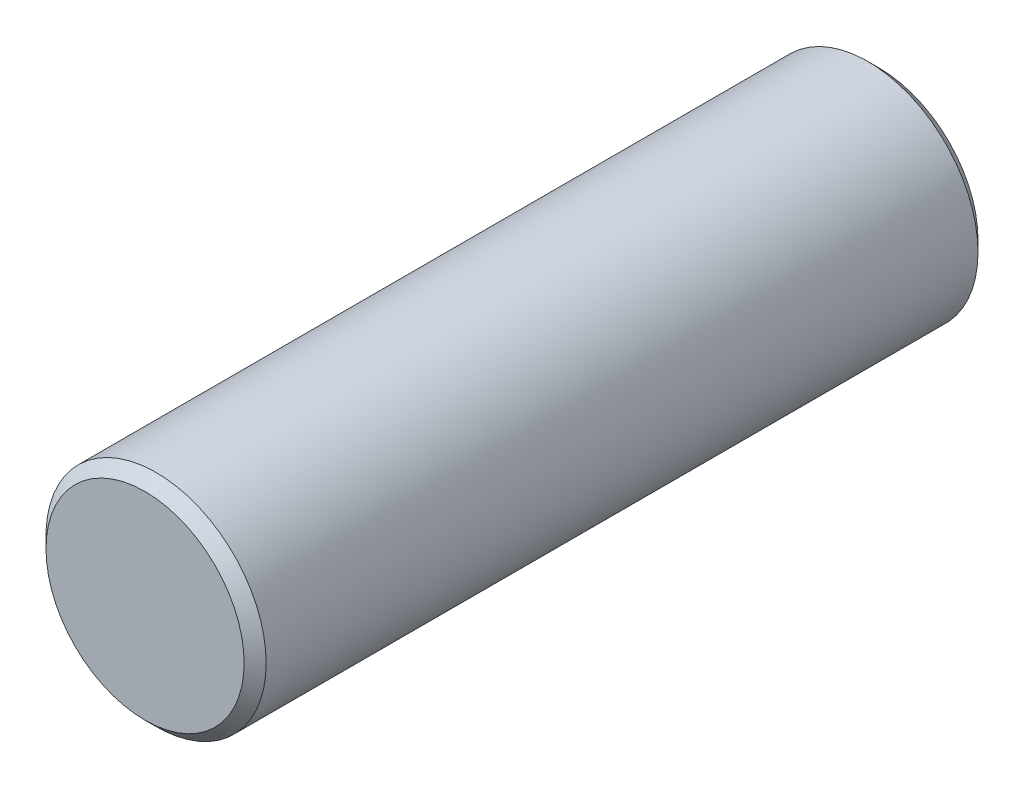
ISO-10303-21;
HEADER;
FILE_DESCRIPTION(('STEP AP214'),'2;1');
FILE_NAME('part.step','',(''),(''),'','','');
FILE_SCHEMA(('AUTOMOTIVE_DESIGN { 1 0 10303 214 1 1 1 1 }'));
ENDSEC;
DATA;
#1=APPLICATION_CONTEXT('core data for automotive mechanical design processes');
#2=APPLICATION_PROTOCOL_DEFINITION('international standard','automotive_design',2000,#1);
#3=PRODUCT_CONTEXT('',#1,'mechanical');
#4=PRODUCT('Part','Part','',(#3));
#5=PRODUCT_RELATED_PRODUCT_CATEGORY('part','',(#4));
#6=PRODUCT_DEFINITION_FORMATION('','',#4);
#7=PRODUCT_DEFINITION_CONTEXT('part definition',#1,'design');
#8=PRODUCT_DEFINITION('design','',#6,#7);
#9=PRODUCT_DEFINITION_SHAPE('','',#8);
#10=(LENGTH_UNIT() NAMED_UNIT(*) SI_UNIT(.MILLI.,.METRE.));
#11=(NAMED_UNIT(*) PLANE_ANGLE_UNIT() SI_UNIT($,.RADIAN.));
#12=(NAMED_UNIT(*) SI_UNIT($,.STERADIAN.) SOLID_ANGLE_UNIT());
#13=UNCERTAINTY_MEASURE_WITH_UNIT(LENGTH_MEASURE(1.E-05),#10,'distance_accuracy_value','');
#14=(GEOMETRIC_REPRESENTATION_CONTEXT(3) GLOBAL_UNCERTAINTY_ASSIGNED_CONTEXT((#13)) GLOBAL_UNIT_ASSIGNED_CONTEXT((#10,
#11,#12)) REPRESENTATION_CONTEXT('',''));
#15=CARTESIAN_POINT('',(0.,0.,0.));
#16=DIRECTION('',(0.,0.,1.));
#17=DIRECTION('',(1.,0.,0.));
#18=AXIS2_PLACEMENT_3D('',#15,#16,#17);
#19=CARTESIAN_POINT('',(0.,0.,-5.));
#20=DIRECTION('',(0.,0.,1.));
#21=DIRECTION('',(1.,0.,0.));
#22=AXIS2_PLACEMENT_3D('',#19,#20,#21);
#23=CYLINDRICAL_SURFACE('',#22,1.5);
#24=CARTESIAN_POINT('',(0.,0.,4.85));
#25=DIRECTION('',(0.,0.,1.));
#26=DIRECTION('',(1.,0.,0.));
#27=AXIS2_PLACEMENT_3D('',#24,#25,#26);
#28=CIRCLE('',#27,1.5);
#29=CARTESIAN_POINT('',(1.5,0.,4.85));
#30=VERTEX_POINT('',#29);
#31=EDGE_CURVE('E41',#30,#30,#28,.F.);
#32=ORIENTED_EDGE('',*,*,#31,.T.);
#33=EDGE_LOOP('',(#32));
#34=FACE_BOUND('',#33,.T.);
#35=CARTESIAN_POINT('',(0.,0.,-4.85));
#36=DIRECTION('',(0.,0.,1.));
#37=DIRECTION('',(1.,0.,0.));
#38=AXIS2_PLACEMENT_3D('',#35,#36,#37);
#39=CIRCLE('',#38,1.5);
#40=CARTESIAN_POINT('',(1.5,0.,-4.85));
#41=VERTEX_POINT('',#40);
#42=EDGE_CURVE('E45',#41,#41,#39,.T.);
#43=ORIENTED_EDGE('',*,*,#42,.T.);
#44=EDGE_LOOP('',(#43));
#45=FACE_BOUND('',#44,.T.);
#46=ADVANCED_FACE('F34',(#34,#45),#23,.T.);
#47=CARTESIAN_POINT('',(0.,0.,-5.));
#48=DIRECTION('',(0.,0.,1.));
#49=DIRECTION('',(1.,0.,0.));
#50=AXIS2_PLACEMENT_3D('',#47,#48,#49);
#51=PLANE('',#50);
#52=CARTESIAN_POINT('',(0.,0.,-5.));
#53=DIRECTION('',(0.,0.,1.));
#54=DIRECTION('',(1.,0.,0.));
#55=AXIS2_PLACEMENT_3D('',#52,#53,#54);
#56=CIRCLE('',#55,1.35);
#57=CARTESIAN_POINT('',(1.35,0.,-5.));
#58=VERTEX_POINT('',#57);
#59=EDGE_CURVE('E10',#58,#58,#56,.F.);
#60=ORIENTED_EDGE('',*,*,#59,.T.);
#61=EDGE_LOOP('',(#60));
#62=FACE_BOUND('',#61,.T.);
#63=ADVANCED_FACE('F65',(#62),#51,.F.);
#64=CARTESIAN_POINT('',(0.,0.,5.));
#65=DIRECTION('',(0.,0.,1.));
#66=DIRECTION('',(1.,0.,0.));
#67=AXIS2_PLACEMENT_3D('',#64,#65,#66);
#68=PLANE('',#67);
#69=CARTESIAN_POINT('',(0.,0.,5.));
#70=DIRECTION('',(0.,0.,1.));
#71=DIRECTION('',(1.,0.,0.));
#72=AXIS2_PLACEMENT_3D('',#69,#70,#71);
#73=CIRCLE('',#72,1.35);
#74=CARTESIAN_POINT('',(1.35,0.,5.));
#75=VERTEX_POINT('',#74);
#76=EDGE_CURVE('E49',#75,#75,#73,.T.);
#77=ORIENTED_EDGE('',*,*,#76,.T.);
#78=EDGE_LOOP('',(#77));
#79=FACE_BOUND('',#78,.T.);
#80=ADVANCED_FACE('F55',(#79),#68,.T.);
#81=CARTESIAN_POINT('',(0.,0.,5.));
#82=DIRECTION('',(0.,0.,-1.));
#83=DIRECTION('',(-1.,0.,0.));
#84=AXIS2_PLACEMENT_3D('',#81,#82,#83);
#85=CONICAL_SURFACE('',#84,1.35,0.785398163397445);
#86=ORIENTED_EDGE('',*,*,#31,.F.);
#87=EDGE_LOOP('',(#86));
#88=FACE_BOUND('',#87,.T.);
#89=ORIENTED_EDGE('',*,*,#76,.F.);
#90=EDGE_LOOP('',(#89));
#91=FACE_BOUND('',#90,.T.);
#92=ADVANCED_FACE('F57',(#88,#91),#85,.T.);
#93=CARTESIAN_POINT('',(0.,0.,-4.85));
#94=DIRECTION('',(0.,0.,1.));
#95=DIRECTION('',(1.,0.,0.));
#96=AXIS2_PLACEMENT_3D('',#93,#94,#95);
#97=CONICAL_SURFACE('',#96,1.5,0.785398163397453);
#98=ORIENTED_EDGE('',*,*,#59,.F.);
#99=EDGE_LOOP('',(#98));
#100=FACE_BOUND('',#99,.T.);
#101=ORIENTED_EDGE('',*,*,#42,.F.);
#102=EDGE_LOOP('',(#101));
#103=FACE_BOUND('',#102,.T.);
#104=ADVANCED_FACE('F36',(#100,#103),#97,.T.);
#105=CLOSED_SHELL('',(#46,#63,#80,#92,#104));
#106=MANIFOLD_SOLID_BREP('B2',#105);
#107=ADVANCED_BREP_SHAPE_REPRESENTATION('',(#18,#106),#14);
#108=SHAPE_DEFINITION_REPRESENTATION(#9,#107);
ENDSEC;
END-ISO-10303-21;
